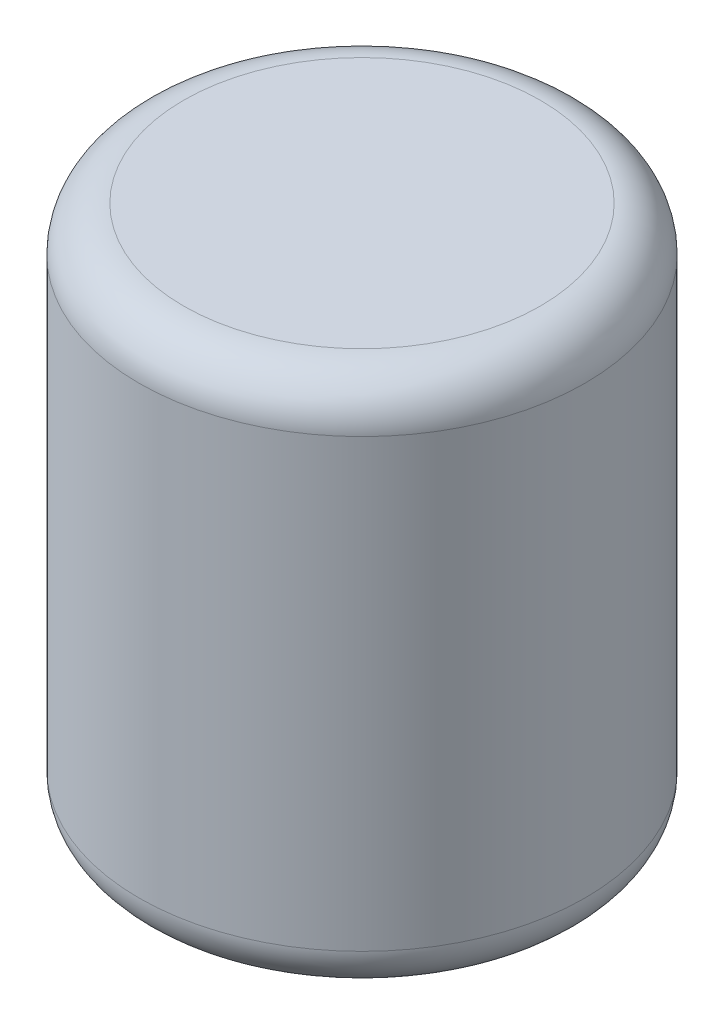
ISO-10303-21;
HEADER;
FILE_DESCRIPTION(('STEP AP214'),'2;1');
FILE_NAME('part.step','',(''),(''),'','','');
FILE_SCHEMA(('AUTOMOTIVE_DESIGN { 1 0 10303 214 1 1 1 1 }'));
ENDSEC;
DATA;
#1=APPLICATION_CONTEXT('core data for automotive mechanical design processes');
#2=APPLICATION_PROTOCOL_DEFINITION('international standard','automotive_design',2000,#1);
#3=PRODUCT_CONTEXT('',#1,'mechanical');
#4=PRODUCT('Part','Part','',(#3));
#5=PRODUCT_RELATED_PRODUCT_CATEGORY('part','',(#4));
#6=PRODUCT_DEFINITION_FORMATION('','',#4);
#7=PRODUCT_DEFINITION_CONTEXT('part definition',#1,'design');
#8=PRODUCT_DEFINITION('design','',#6,#7);
#9=PRODUCT_DEFINITION_SHAPE('','',#8);
#10=(LENGTH_UNIT() NAMED_UNIT(*) SI_UNIT(.MILLI.,.METRE.));
#11=(NAMED_UNIT(*) PLANE_ANGLE_UNIT() SI_UNIT($,.RADIAN.));
#12=(NAMED_UNIT(*) SI_UNIT($,.STERADIAN.) SOLID_ANGLE_UNIT());
#13=UNCERTAINTY_MEASURE_WITH_UNIT(LENGTH_MEASURE(1.E-05),#10,'distance_accuracy_value','');
#14=(GEOMETRIC_REPRESENTATION_CONTEXT(3) GLOBAL_UNCERTAINTY_ASSIGNED_CONTEXT((#13)) GLOBAL_UNIT_ASSIGNED_CONTEXT((#10,
#11,#12)) REPRESENTATION_CONTEXT('',''));
#15=CARTESIAN_POINT('',(0.,0.,0.));
#16=DIRECTION('',(0.,0.,1.));
#17=DIRECTION('',(1.,0.,0.));
#18=AXIS2_PLACEMENT_3D('',#15,#16,#17);
#19=CARTESIAN_POINT('',(0.,152.4,0.));
#20=DIRECTION('',(0.,-1.,0.));
#21=DIRECTION('',(0.,0.,-1.));
#22=AXIS2_PLACEMENT_3D('',#19,#20,#21);
#23=CYLINDRICAL_SURFACE('',#22,63.5);
#24=CARTESIAN_POINT('',(0.,12.7,0.));
#25=DIRECTION('',(0.,1.,0.));
#26=DIRECTION('',(0.,0.,1.));
#27=AXIS2_PLACEMENT_3D('',#24,#25,#26);
#28=CIRCLE('',#27,63.5);
#29=CARTESIAN_POINT('',(0.,12.7,63.5));
#30=VERTEX_POINT('',#29);
#31=EDGE_CURVE('E48',#30,#30,#28,.T.);
#32=ORIENTED_EDGE('',*,*,#31,.T.);
#33=EDGE_LOOP('',(#32));
#34=FACE_BOUND('',#33,.T.);
#35=CARTESIAN_POINT('',(0.,139.7,0.));
#36=DIRECTION('',(0.,1.,0.));
#37=DIRECTION('',(0.,0.,1.));
#38=AXIS2_PLACEMENT_3D('',#35,#36,#37);
#39=CIRCLE('',#38,63.5);
#40=CARTESIAN_POINT('',(0.,139.7,63.5));
#41=VERTEX_POINT('',#40);
#42=EDGE_CURVE('E52',#41,#41,#39,.F.);
#43=ORIENTED_EDGE('',*,*,#42,.T.);
#44=EDGE_LOOP('',(#43));
#45=FACE_BOUND('',#44,.T.);
#46=ADVANCED_FACE('F37',(#34,#45),#23,.T.);
#47=CARTESIAN_POINT('',(0.,152.4,0.));
#48=DIRECTION('',(0.,1.,0.));
#49=DIRECTION('',(0.,0.,1.));
#50=AXIS2_PLACEMENT_3D('',#47,#48,#49);
#51=PLANE('',#50);
#52=CARTESIAN_POINT('',(0.,152.4,0.));
#53=DIRECTION('',(0.,1.,0.));
#54=DIRECTION('',(0.,0.,1.));
#55=AXIS2_PLACEMENT_3D('',#52,#53,#54);
#56=CIRCLE('',#55,50.8);
#57=CARTESIAN_POINT('',(0.,152.4,50.8));
#58=VERTEX_POINT('',#57);
#59=EDGE_CURVE('E10',#58,#58,#56,.T.);
#60=ORIENTED_EDGE('',*,*,#59,.T.);
#61=EDGE_LOOP('',(#60));
#62=FACE_BOUND('',#61,.T.);
#63=ADVANCED_FACE('F68',(#62),#51,.T.);
#64=CARTESIAN_POINT('',(0.,0.,0.));
#65=DIRECTION('',(0.,1.,0.));
#66=DIRECTION('',(0.,0.,1.));
#67=AXIS2_PLACEMENT_3D('',#64,#65,#66);
#68=PLANE('',#67);
#69=CARTESIAN_POINT('',(0.,0.,0.));
#70=DIRECTION('',(0.,1.,0.));
#71=DIRECTION('',(0.,0.,1.));
#72=AXIS2_PLACEMENT_3D('',#69,#70,#71);
#73=CIRCLE('',#72,50.8);
#74=CARTESIAN_POINT('',(0.,0.,50.8));
#75=VERTEX_POINT('',#74);
#76=EDGE_CURVE('E44',#75,#75,#73,.F.);
#77=ORIENTED_EDGE('',*,*,#76,.T.);
#78=EDGE_LOOP('',(#77));
#79=FACE_BOUND('',#78,.T.);
#80=ADVANCED_FACE('F65',(#79),#68,.F.);
#81=CARTESIAN_POINT('',(0.,12.7,0.));
#82=DIRECTION('',(0.,1.,0.));
#83=DIRECTION('',(0.,0.,1.));
#84=AXIS2_PLACEMENT_3D('',#81,#82,#83);
#85=TOROIDAL_SURFACE('',#84,50.8,12.7);
#86=ORIENTED_EDGE('',*,*,#76,.F.);
#87=EDGE_LOOP('',(#86));
#88=FACE_BOUND('',#87,.T.);
#89=ORIENTED_EDGE('',*,*,#31,.F.);
#90=EDGE_LOOP('',(#89));
#91=FACE_BOUND('',#90,.T.);
#92=ADVANCED_FACE('F61',(#88,#91),#85,.T.);
#93=CARTESIAN_POINT('',(0.,139.7,0.));
#94=DIRECTION('',(0.,1.,0.));
#95=DIRECTION('',(0.,0.,1.));
#96=AXIS2_PLACEMENT_3D('',#93,#94,#95);
#97=TOROIDAL_SURFACE('',#96,50.8,12.7);
#98=ORIENTED_EDGE('',*,*,#42,.F.);
#99=EDGE_LOOP('',(#98));
#100=FACE_BOUND('',#99,.T.);
#101=ORIENTED_EDGE('',*,*,#59,.F.);
#102=EDGE_LOOP('',(#101));
#103=FACE_BOUND('',#102,.T.);
#104=ADVANCED_FACE('F39',(#100,#103),#97,.T.);
#105=CLOSED_SHELL('',(#46,#63,#80,#92,#104));
#106=MANIFOLD_SOLID_BREP('B2',#105);
#107=ADVANCED_BREP_SHAPE_REPRESENTATION('',(#18,#106),#14);
#108=SHAPE_DEFINITION_REPRESENTATION(#9,#107);
ENDSEC;
END-ISO-10303-21;
